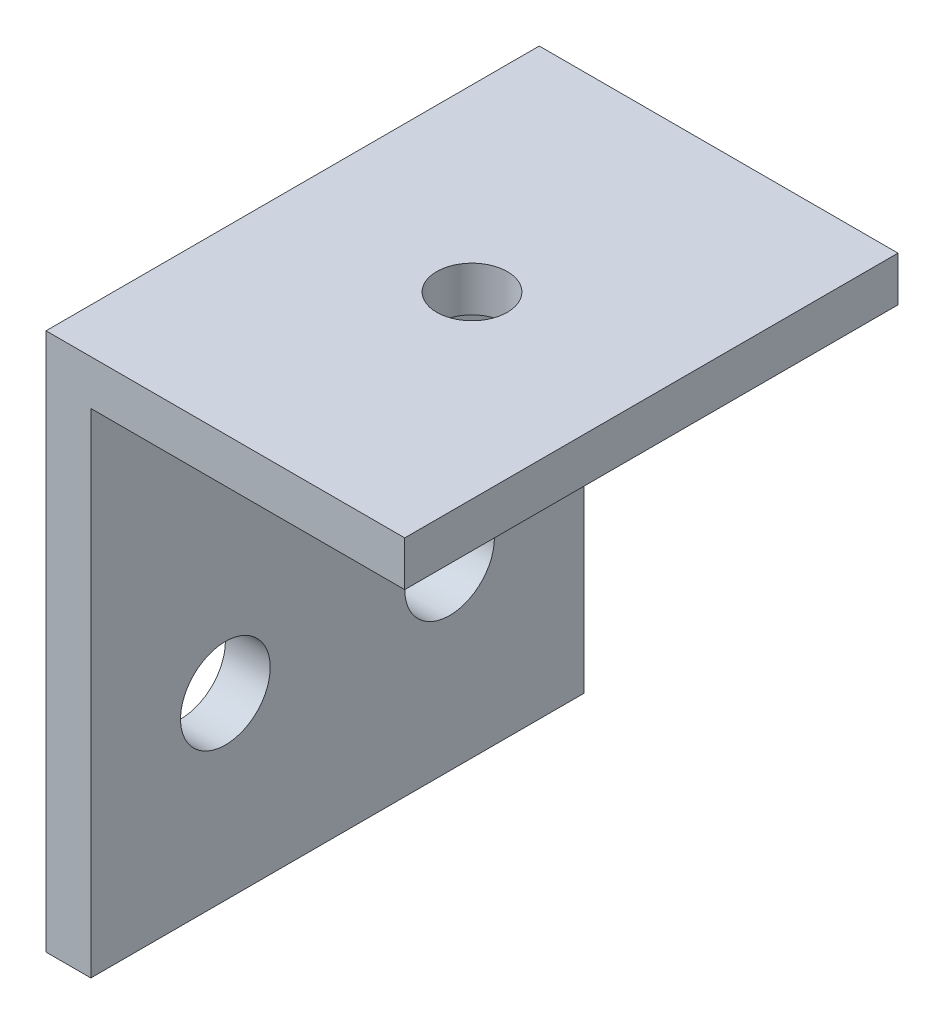
ISO-10303-21;
HEADER;
FILE_DESCRIPTION(('STEP AP214'),'2;1');
FILE_NAME('part.step','',(''),(''),'','','');
FILE_SCHEMA(('AUTOMOTIVE_DESIGN { 1 0 10303 214 1 1 1 1 }'));
ENDSEC;
DATA;
#1=APPLICATION_CONTEXT('core data for automotive mechanical design processes');
#2=APPLICATION_PROTOCOL_DEFINITION('international standard','automotive_design',2000,#1);
#3=PRODUCT_CONTEXT('',#1,'mechanical');
#4=PRODUCT('Part','Part','',(#3));
#5=PRODUCT_RELATED_PRODUCT_CATEGORY('part','',(#4));
#6=PRODUCT_DEFINITION_FORMATION('','',#4);
#7=PRODUCT_DEFINITION_CONTEXT('part definition',#1,'design');
#8=PRODUCT_DEFINITION('design','',#6,#7);
#9=PRODUCT_DEFINITION_SHAPE('','',#8);
#10=(LENGTH_UNIT() NAMED_UNIT(*) SI_UNIT(.MILLI.,.METRE.));
#11=(NAMED_UNIT(*) PLANE_ANGLE_UNIT() SI_UNIT($,.RADIAN.));
#12=(NAMED_UNIT(*) SI_UNIT($,.STERADIAN.) SOLID_ANGLE_UNIT());
#13=UNCERTAINTY_MEASURE_WITH_UNIT(LENGTH_MEASURE(1.E-05),#10,'distance_accuracy_value','');
#14=(GEOMETRIC_REPRESENTATION_CONTEXT(3) GLOBAL_UNCERTAINTY_ASSIGNED_CONTEXT((#13)) GLOBAL_UNIT_ASSIGNED_CONTEXT((#10,
#11,#12)) REPRESENTATION_CONTEXT('',''));
#15=CARTESIAN_POINT('',(0.,0.,0.));
#16=DIRECTION('',(0.,0.,1.));
#17=DIRECTION('',(1.,0.,0.));
#18=AXIS2_PLACEMENT_3D('',#15,#16,#17);
#19=CARTESIAN_POINT('',(0.,0.,34.925));
#20=DIRECTION('',(1.,0.,0.));
#21=DIRECTION('',(0.,0.,-1.));
#22=AXIS2_PLACEMENT_3D('',#19,#20,#21);
#23=PLANE('',#22);
#24=CARTESIAN_POINT('',(0.,12.7,9.525));
#25=DIRECTION('',(1.,0.,0.));
#26=DIRECTION('',(0.,0.,-1.));
#27=AXIS2_PLACEMENT_3D('',#24,#25,#26);
#28=CIRCLE('',#27,3.175);
#29=CARTESIAN_POINT('',(0.,12.7,6.35));
#30=VERTEX_POINT('',#29);
#31=EDGE_CURVE('E161',#30,#30,#28,.T.);
#32=ORIENTED_EDGE('',*,*,#31,.T.);
#33=EDGE_LOOP('',(#32));
#34=FACE_BOUND('',#33,.T.);
#35=CARTESIAN_POINT('',(0.,12.7,25.4));
#36=DIRECTION('',(1.,0.,0.));
#37=DIRECTION('',(0.,0.,-1.));
#38=AXIS2_PLACEMENT_3D('',#35,#36,#37);
#39=CIRCLE('',#38,3.175);
#40=CARTESIAN_POINT('',(0.,12.7,22.225));
#41=VERTEX_POINT('',#40);
#42=EDGE_CURVE('E120',#41,#41,#39,.T.);
#43=ORIENTED_EDGE('',*,*,#42,.T.);
#44=EDGE_LOOP('',(#43));
#45=FACE_BOUND('',#44,.T.);
#46=DIRECTION('',(0.,-1.,0.));
#47=VECTOR('',#46,1.);
#48=CARTESIAN_POINT('',(0.,0.,0.));
#49=LINE('',#48,#47);
#50=CARTESIAN_POINT('',(0.,38.1,0.));
#51=VERTEX_POINT('',#50);
#52=CARTESIAN_POINT('',(0.,0.,0.));
#53=VERTEX_POINT('',#52);
#54=EDGE_CURVE('E116',#51,#53,#49,.T.);
#55=ORIENTED_EDGE('',*,*,#54,.T.);
#56=DIRECTION('',(0.,0.,-1.));
#57=VECTOR('',#56,1.);
#58=CARTESIAN_POINT('',(0.,0.,34.925));
#59=LINE('',#58,#57);
#60=CARTESIAN_POINT('',(0.,0.,34.925));
#61=VERTEX_POINT('',#60);
#62=EDGE_CURVE('E11',#61,#53,#59,.T.);
#63=ORIENTED_EDGE('',*,*,#62,.F.);
#64=DIRECTION('',(0.,-1.,0.));
#65=VECTOR('',#64,1.);
#66=CARTESIAN_POINT('',(0.,0.,34.925));
#67=LINE('',#66,#65);
#68=CARTESIAN_POINT('',(0.,38.1,34.925));
#69=VERTEX_POINT('',#68);
#70=EDGE_CURVE('E127',#69,#61,#67,.T.);
#71=ORIENTED_EDGE('',*,*,#70,.F.);
#72=DIRECTION('',(0.,0.,-1.));
#73=VECTOR('',#72,1.);
#74=CARTESIAN_POINT('',(0.,38.1,34.925));
#75=LINE('',#74,#73);
#76=EDGE_CURVE('E112',#69,#51,#75,.T.);
#77=ORIENTED_EDGE('',*,*,#76,.T.);
#78=EDGE_LOOP('',(#55,#63,#71,#77));
#79=FACE_BOUND('',#78,.T.);
#80=ADVANCED_FACE('F32',(#34,#45,#79),#23,.F.);
#81=CARTESIAN_POINT('',(0.,0.,34.925));
#82=DIRECTION('',(0.,1.,0.));
#83=DIRECTION('',(-1.,0.,0.));
#84=AXIS2_PLACEMENT_3D('',#81,#82,#83);
#85=PLANE('',#84);
#86=DIRECTION('',(1.,0.,0.));
#87=VECTOR('',#86,1.);
#88=CARTESIAN_POINT('',(0.,0.,0.));
#89=LINE('',#88,#87);
#90=CARTESIAN_POINT('',(3.175,0.,0.));
#91=VERTEX_POINT('',#90);
#92=EDGE_CURVE('E119',#53,#91,#89,.T.);
#93=ORIENTED_EDGE('',*,*,#92,.T.);
#94=DIRECTION('',(0.,0.,-1.));
#95=VECTOR('',#94,1.);
#96=CARTESIAN_POINT('',(3.175,0.,34.925));
#97=LINE('',#96,#95);
#98=CARTESIAN_POINT('',(3.175,0.,34.925));
#99=VERTEX_POINT('',#98);
#100=EDGE_CURVE('E40',#99,#91,#97,.T.);
#101=ORIENTED_EDGE('',*,*,#100,.F.);
#102=DIRECTION('',(1.,0.,0.));
#103=VECTOR('',#102,1.);
#104=CARTESIAN_POINT('',(0.,0.,34.925));
#105=LINE('',#104,#103);
#106=EDGE_CURVE('E85',#61,#99,#105,.T.);
#107=ORIENTED_EDGE('',*,*,#106,.F.);
#108=ORIENTED_EDGE('',*,*,#62,.T.);
#109=EDGE_LOOP('',(#93,#101,#107,#108));
#110=FACE_BOUND('',#109,.T.);
#111=ADVANCED_FACE('F153',(#110),#85,.F.);
#112=CARTESIAN_POINT('',(3.175,0.,34.925));
#113=DIRECTION('',(-1.,0.,0.));
#114=DIRECTION('',(0.,-1.,0.));
#115=AXIS2_PLACEMENT_3D('',#112,#113,#114);
#116=PLANE('',#115);
#117=CARTESIAN_POINT('',(3.175,12.7,9.525));
#118=DIRECTION('',(1.,0.,0.));
#119=DIRECTION('',(0.,0.,-1.));
#120=AXIS2_PLACEMENT_3D('',#117,#118,#119);
#121=CIRCLE('',#120,3.175);
#122=CARTESIAN_POINT('',(3.175,12.7,6.35));
#123=VERTEX_POINT('',#122);
#124=EDGE_CURVE('E170',#123,#123,#121,.T.);
#125=ORIENTED_EDGE('',*,*,#124,.F.);
#126=EDGE_LOOP('',(#125));
#127=FACE_BOUND('',#126,.T.);
#128=CARTESIAN_POINT('',(3.175,12.7,25.4));
#129=DIRECTION('',(1.,0.,0.));
#130=DIRECTION('',(0.,0.,-1.));
#131=AXIS2_PLACEMENT_3D('',#128,#129,#130);
#132=CIRCLE('',#131,3.175);
#133=CARTESIAN_POINT('',(3.175,12.7,22.225));
#134=VERTEX_POINT('',#133);
#135=EDGE_CURVE('E165',#134,#134,#132,.T.);
#136=ORIENTED_EDGE('',*,*,#135,.F.);
#137=EDGE_LOOP('',(#136));
#138=FACE_BOUND('',#137,.T.);
#139=DIRECTION('',(0.,1.,0.));
#140=VECTOR('',#139,1.);
#141=CARTESIAN_POINT('',(3.175,0.,0.));
#142=LINE('',#141,#140);
#143=CARTESIAN_POINT('',(3.175,34.925,0.));
#144=VERTEX_POINT('',#143);
#145=EDGE_CURVE('E122',#91,#144,#142,.T.);
#146=ORIENTED_EDGE('',*,*,#145,.T.);
#147=DIRECTION('',(0.,0.,-1.));
#148=VECTOR('',#147,1.);
#149=CARTESIAN_POINT('',(3.175,34.925,34.925));
#150=LINE('',#149,#148);
#151=CARTESIAN_POINT('',(3.175,34.925,34.925));
#152=VERTEX_POINT('',#151);
#153=EDGE_CURVE('E107',#152,#144,#150,.T.);
#154=ORIENTED_EDGE('',*,*,#153,.F.);
#155=DIRECTION('',(0.,1.,0.));
#156=VECTOR('',#155,1.);
#157=CARTESIAN_POINT('',(3.175,0.,34.925));
#158=LINE('',#157,#156);
#159=EDGE_CURVE('E98',#99,#152,#158,.T.);
#160=ORIENTED_EDGE('',*,*,#159,.F.);
#161=ORIENTED_EDGE('',*,*,#100,.T.);
#162=EDGE_LOOP('',(#146,#154,#160,#161));
#163=FACE_BOUND('',#162,.T.);
#164=ADVANCED_FACE('F133',(#127,#138,#163),#116,.F.);
#165=CARTESIAN_POINT('',(25.4,34.925,34.925));
#166=DIRECTION('',(0.,1.,0.));
#167=DIRECTION('',(0.,0.,1.));
#168=AXIS2_PLACEMENT_3D('',#165,#166,#167);
#169=PLANE('',#168);
#170=CARTESIAN_POINT('',(12.7,34.925,17.4625));
#171=DIRECTION('',(0.,1.,0.));
#172=DIRECTION('',(0.,0.,1.));
#173=AXIS2_PLACEMENT_3D('',#170,#171,#172);
#174=CIRCLE('',#173,2.5);
#175=CARTESIAN_POINT('',(12.7,34.925,19.9625));
#176=VERTEX_POINT('',#175);
#177=EDGE_CURVE('E175',#176,#176,#174,.T.);
#178=ORIENTED_EDGE('',*,*,#177,.T.);
#179=EDGE_LOOP('',(#178));
#180=FACE_BOUND('',#179,.T.);
#181=DIRECTION('',(1.,0.,0.));
#182=VECTOR('',#181,1.);
#183=CARTESIAN_POINT('',(25.4,34.925,0.));
#184=LINE('',#183,#182);
#185=CARTESIAN_POINT('',(25.4,34.925,0.));
#186=VERTEX_POINT('',#185);
#187=EDGE_CURVE('E106',#144,#186,#184,.T.);
#188=ORIENTED_EDGE('',*,*,#187,.T.);
#189=DIRECTION('',(0.,0.,-1.));
#190=VECTOR('',#189,1.);
#191=CARTESIAN_POINT('',(25.4,34.925,34.925));
#192=LINE('',#191,#190);
#193=CARTESIAN_POINT('',(25.4,34.925,34.925));
#194=VERTEX_POINT('',#193);
#195=EDGE_CURVE('E103',#194,#186,#192,.T.);
#196=ORIENTED_EDGE('',*,*,#195,.F.);
#197=DIRECTION('',(1.,0.,0.));
#198=VECTOR('',#197,1.);
#199=CARTESIAN_POINT('',(25.4,34.925,34.925));
#200=LINE('',#199,#198);
#201=EDGE_CURVE('E92',#152,#194,#200,.T.);
#202=ORIENTED_EDGE('',*,*,#201,.F.);
#203=ORIENTED_EDGE('',*,*,#153,.T.);
#204=EDGE_LOOP('',(#188,#196,#202,#203));
#205=FACE_BOUND('',#204,.T.);
#206=ADVANCED_FACE('F104',(#180,#205),#169,.F.);
#207=CARTESIAN_POINT('',(25.4,34.925,34.925));
#208=DIRECTION('',(-1.,0.,0.));
#209=DIRECTION('',(0.,0.,1.));
#210=AXIS2_PLACEMENT_3D('',#207,#208,#209);
#211=PLANE('',#210);
#212=DIRECTION('',(0.,1.,0.));
#213=VECTOR('',#212,1.);
#214=CARTESIAN_POINT('',(25.4,34.925,0.));
#215=LINE('',#214,#213);
#216=CARTESIAN_POINT('',(25.4,38.1,0.));
#217=VERTEX_POINT('',#216);
#218=EDGE_CURVE('E71',#186,#217,#215,.T.);
#219=ORIENTED_EDGE('',*,*,#218,.T.);
#220=DIRECTION('',(0.,0.,-1.));
#221=VECTOR('',#220,1.);
#222=CARTESIAN_POINT('',(25.4,38.1,34.925));
#223=LINE('',#222,#221);
#224=CARTESIAN_POINT('',(25.4,38.1,34.925));
#225=VERTEX_POINT('',#224);
#226=EDGE_CURVE('E108',#225,#217,#223,.T.);
#227=ORIENTED_EDGE('',*,*,#226,.F.);
#228=DIRECTION('',(0.,1.,0.));
#229=VECTOR('',#228,1.);
#230=CARTESIAN_POINT('',(25.4,34.925,34.925));
#231=LINE('',#230,#229);
#232=EDGE_CURVE('E96',#194,#225,#231,.T.);
#233=ORIENTED_EDGE('',*,*,#232,.F.);
#234=ORIENTED_EDGE('',*,*,#195,.T.);
#235=EDGE_LOOP('',(#219,#227,#233,#234));
#236=FACE_BOUND('',#235,.T.);
#237=ADVANCED_FACE('F110',(#236),#211,.F.);
#238=CARTESIAN_POINT('',(0.,38.1,34.925));
#239=DIRECTION('',(0.,-1.,0.));
#240=DIRECTION('',(0.,0.,-1.));
#241=AXIS2_PLACEMENT_3D('',#238,#239,#240);
#242=PLANE('',#241);
#243=CARTESIAN_POINT('',(12.7,38.1,17.4625));
#244=DIRECTION('',(0.,1.,0.));
#245=DIRECTION('',(0.,0.,1.));
#246=AXIS2_PLACEMENT_3D('',#243,#244,#245);
#247=CIRCLE('',#246,2.5);
#248=CARTESIAN_POINT('',(12.7,38.1,19.9625));
#249=VERTEX_POINT('',#248);
#250=EDGE_CURVE('E179',#249,#249,#247,.T.);
#251=ORIENTED_EDGE('',*,*,#250,.F.);
#252=EDGE_LOOP('',(#251));
#253=FACE_BOUND('',#252,.T.);
#254=DIRECTION('',(-1.,0.,0.));
#255=VECTOR('',#254,1.);
#256=CARTESIAN_POINT('',(0.,38.1,0.));
#257=LINE('',#256,#255);
#258=EDGE_CURVE('E77',#217,#51,#257,.T.);
#259=ORIENTED_EDGE('',*,*,#258,.T.);
#260=ORIENTED_EDGE('',*,*,#76,.F.);
#261=DIRECTION('',(-1.,0.,0.));
#262=VECTOR('',#261,1.);
#263=CARTESIAN_POINT('',(0.,38.1,34.925));
#264=LINE('',#263,#262);
#265=EDGE_CURVE('E48',#225,#69,#264,.T.);
#266=ORIENTED_EDGE('',*,*,#265,.F.);
#267=ORIENTED_EDGE('',*,*,#226,.T.);
#268=EDGE_LOOP('',(#259,#260,#266,#267));
#269=FACE_BOUND('',#268,.T.);
#270=ADVANCED_FACE('F140',(#253,#269),#242,.F.);
#271=CARTESIAN_POINT('',(0.,0.,34.925));
#272=DIRECTION('',(0.,0.,-1.));
#273=DIRECTION('',(-1.,0.,0.));
#274=AXIS2_PLACEMENT_3D('',#271,#272,#273);
#275=PLANE('',#274);
#276=ORIENTED_EDGE('',*,*,#70,.T.);
#277=ORIENTED_EDGE('',*,*,#106,.T.);
#278=ORIENTED_EDGE('',*,*,#159,.T.);
#279=ORIENTED_EDGE('',*,*,#201,.T.);
#280=ORIENTED_EDGE('',*,*,#232,.T.);
#281=ORIENTED_EDGE('',*,*,#265,.T.);
#282=EDGE_LOOP('',(#276,#277,#278,#279,#280,#281));
#283=FACE_BOUND('',#282,.T.);
#284=ADVANCED_FACE('F94',(#283),#275,.F.);
#285=CARTESIAN_POINT('',(0.,0.,0.));
#286=DIRECTION('',(0.,0.,-1.));
#287=DIRECTION('',(-1.,0.,0.));
#288=AXIS2_PLACEMENT_3D('',#285,#286,#287);
#289=PLANE('',#288);
#290=ORIENTED_EDGE('',*,*,#54,.F.);
#291=ORIENTED_EDGE('',*,*,#258,.F.);
#292=ORIENTED_EDGE('',*,*,#218,.F.);
#293=ORIENTED_EDGE('',*,*,#187,.F.);
#294=ORIENTED_EDGE('',*,*,#145,.F.);
#295=ORIENTED_EDGE('',*,*,#92,.F.);
#296=EDGE_LOOP('',(#290,#291,#292,#293,#294,#295));
#297=FACE_BOUND('',#296,.T.);
#298=ADVANCED_FACE('F136',(#297),#289,.T.);
#299=CARTESIAN_POINT('',(0.,12.7,25.4));
#300=DIRECTION('',(1.,0.,0.));
#301=DIRECTION('',(0.,0.,-1.));
#302=AXIS2_PLACEMENT_3D('',#299,#300,#301);
#303=CYLINDRICAL_SURFACE('',#302,3.175);
#304=ORIENTED_EDGE('',*,*,#42,.F.);
#305=EDGE_LOOP('',(#304));
#306=FACE_BOUND('',#305,.T.);
#307=ORIENTED_EDGE('',*,*,#135,.T.);
#308=EDGE_LOOP('',(#307));
#309=FACE_BOUND('',#308,.T.);
#310=ADVANCED_FACE('F202',(#306,#309),#303,.F.);
#311=CARTESIAN_POINT('',(0.,12.7,9.525));
#312=DIRECTION('',(1.,0.,0.));
#313=DIRECTION('',(0.,0.,-1.));
#314=AXIS2_PLACEMENT_3D('',#311,#312,#313);
#315=CYLINDRICAL_SURFACE('',#314,3.175);
#316=ORIENTED_EDGE('',*,*,#31,.F.);
#317=EDGE_LOOP('',(#316));
#318=FACE_BOUND('',#317,.T.);
#319=ORIENTED_EDGE('',*,*,#124,.T.);
#320=EDGE_LOOP('',(#319));
#321=FACE_BOUND('',#320,.T.);
#322=ADVANCED_FACE('F185',(#318,#321),#315,.F.);
#323=CARTESIAN_POINT('',(12.7,0.,17.4625));
#324=DIRECTION('',(0.,1.,0.));
#325=DIRECTION('',(0.,0.,1.));
#326=AXIS2_PLACEMENT_3D('',#323,#324,#325);
#327=CYLINDRICAL_SURFACE('',#326,2.5);
#328=ORIENTED_EDGE('',*,*,#250,.T.);
#329=EDGE_LOOP('',(#328));
#330=FACE_BOUND('',#329,.T.);
#331=ORIENTED_EDGE('',*,*,#177,.F.);
#332=EDGE_LOOP('',(#331));
#333=FACE_BOUND('',#332,.T.);
#334=ADVANCED_FACE('F182',(#330,#333),#327,.F.);
#335=CLOSED_SHELL('',(#80,#111,#164,#206,#237,#270,#284,#298,#310,#322,#334));
#336=MANIFOLD_SOLID_BREP('B2',#335);
#337=ADVANCED_BREP_SHAPE_REPRESENTATION('',(#18,#336),#14);
#338=SHAPE_DEFINITION_REPRESENTATION(#9,#337);
ENDSEC;
END-ISO-10303-21;
